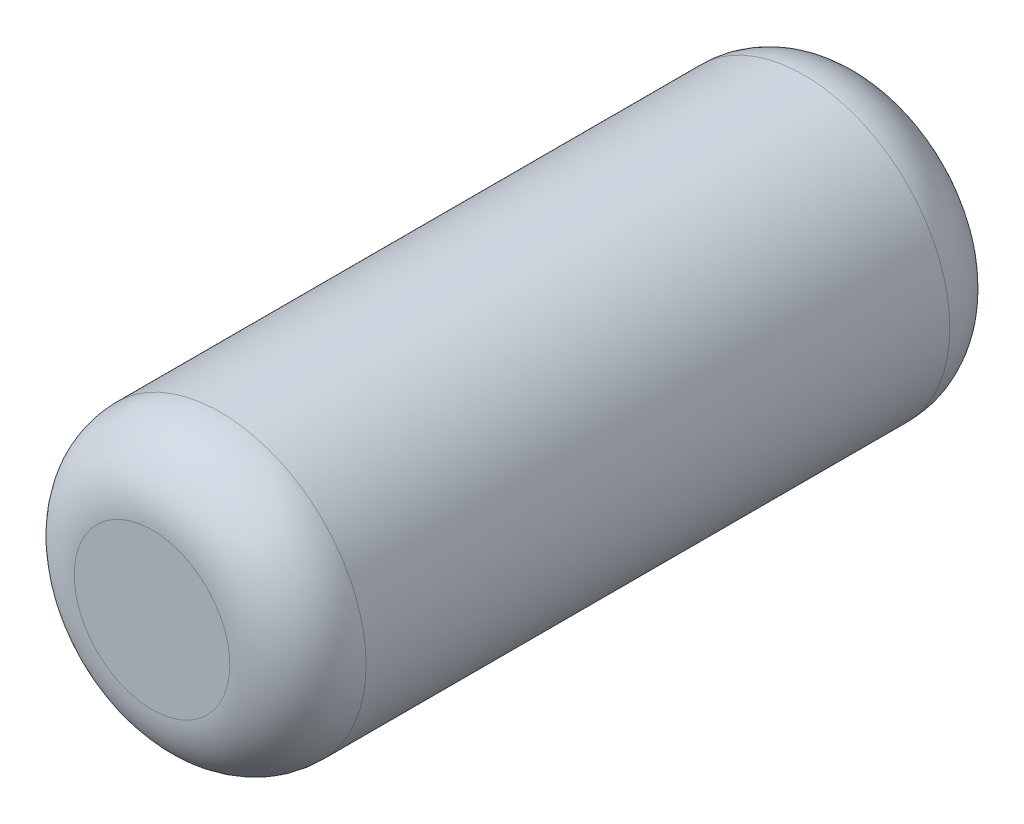
ISO-10303-21;
HEADER;
FILE_DESCRIPTION(('STEP AP214'),'2;1');
FILE_NAME('part.step','',(''),(''),'','','');
FILE_SCHEMA(('AUTOMOTIVE_DESIGN { 1 0 10303 214 1 1 1 1 }'));
ENDSEC;
DATA;
#1=APPLICATION_CONTEXT('core data for automotive mechanical design processes');
#2=APPLICATION_PROTOCOL_DEFINITION('international standard','automotive_design',2000,#1);
#3=PRODUCT_CONTEXT('',#1,'mechanical');
#4=PRODUCT('Part','Part','',(#3));
#5=PRODUCT_RELATED_PRODUCT_CATEGORY('part','',(#4));
#6=PRODUCT_DEFINITION_FORMATION('','',#4);
#7=PRODUCT_DEFINITION_CONTEXT('part definition',#1,'design');
#8=PRODUCT_DEFINITION('design','',#6,#7);
#9=PRODUCT_DEFINITION_SHAPE('','',#8);
#10=(LENGTH_UNIT() NAMED_UNIT(*) SI_UNIT(.MILLI.,.METRE.));
#11=(NAMED_UNIT(*) PLANE_ANGLE_UNIT() SI_UNIT($,.RADIAN.));
#12=(NAMED_UNIT(*) SI_UNIT($,.STERADIAN.) SOLID_ANGLE_UNIT());
#13=UNCERTAINTY_MEASURE_WITH_UNIT(LENGTH_MEASURE(1.E-05),#10,'distance_accuracy_value','');
#14=(GEOMETRIC_REPRESENTATION_CONTEXT(3) GLOBAL_UNCERTAINTY_ASSIGNED_CONTEXT((#13)) GLOBAL_UNIT_ASSIGNED_CONTEXT((#10,
#11,#12)) REPRESENTATION_CONTEXT('',''));
#15=CARTESIAN_POINT('',(0.,0.,0.));
#16=DIRECTION('',(0.,0.,1.));
#17=DIRECTION('',(1.,0.,0.));
#18=AXIS2_PLACEMENT_3D('',#15,#16,#17);
#19=CARTESIAN_POINT('',(0.,0.,1.85));
#20=DIRECTION('',(0.,0.,-1.));
#21=DIRECTION('',(-1.,0.,0.));
#22=AXIS2_PLACEMENT_3D('',#19,#20,#21);
#23=CYLINDRICAL_SURFACE('',#22,0.75);
#24=CARTESIAN_POINT('',(0.,0.,-1.5));
#25=DIRECTION('',(0.,0.,1.));
#26=DIRECTION('',(1.,0.,0.));
#27=AXIS2_PLACEMENT_3D('',#24,#25,#26);
#28=CIRCLE('',#27,0.75);
#29=CARTESIAN_POINT('',(0.75,0.,-1.5));
#30=VERTEX_POINT('',#29);
#31=EDGE_CURVE('E42',#30,#30,#28,.T.);
#32=ORIENTED_EDGE('',*,*,#31,.T.);
#33=EDGE_LOOP('',(#32));
#34=FACE_BOUND('',#33,.T.);
#35=CARTESIAN_POINT('',(0.,0.,1.5));
#36=DIRECTION('',(0.,0.,1.));
#37=DIRECTION('',(1.,0.,0.));
#38=AXIS2_PLACEMENT_3D('',#35,#36,#37);
#39=CIRCLE('',#38,0.75);
#40=CARTESIAN_POINT('',(0.75,0.,1.5));
#41=VERTEX_POINT('',#40);
#42=EDGE_CURVE('E46',#41,#41,#39,.F.);
#43=ORIENTED_EDGE('',*,*,#42,.T.);
#44=EDGE_LOOP('',(#43));
#45=FACE_BOUND('',#44,.T.);
#46=ADVANCED_FACE('F31',(#34,#45),#23,.T.);
#47=CARTESIAN_POINT('',(0.,0.,1.85));
#48=DIRECTION('',(0.,0.,1.));
#49=DIRECTION('',(1.,0.,0.));
#50=AXIS2_PLACEMENT_3D('',#47,#48,#49);
#51=PLANE('',#50);
#52=CARTESIAN_POINT('',(0.,0.,1.85));
#53=DIRECTION('',(0.,0.,1.));
#54=DIRECTION('',(1.,0.,0.));
#55=AXIS2_PLACEMENT_3D('',#52,#53,#54);
#56=CIRCLE('',#55,0.4);
#57=CARTESIAN_POINT('',(0.4,0.,1.85));
#58=VERTEX_POINT('',#57);
#59=EDGE_CURVE('E10',#58,#58,#56,.T.);
#60=ORIENTED_EDGE('',*,*,#59,.T.);
#61=EDGE_LOOP('',(#60));
#62=FACE_BOUND('',#61,.T.);
#63=ADVANCED_FACE('F62',(#62),#51,.T.);
#64=CARTESIAN_POINT('',(0.,0.,-1.85));
#65=DIRECTION('',(0.,0.,1.));
#66=DIRECTION('',(1.,0.,0.));
#67=AXIS2_PLACEMENT_3D('',#64,#65,#66);
#68=PLANE('',#67);
#69=CARTESIAN_POINT('',(0.,0.,-1.85));
#70=DIRECTION('',(0.,0.,1.));
#71=DIRECTION('',(1.,0.,0.));
#72=AXIS2_PLACEMENT_3D('',#69,#70,#71);
#73=CIRCLE('',#72,0.4);
#74=CARTESIAN_POINT('',(0.4,0.,-1.85));
#75=VERTEX_POINT('',#74);
#76=EDGE_CURVE('E38',#75,#75,#73,.F.);
#77=ORIENTED_EDGE('',*,*,#76,.T.);
#78=EDGE_LOOP('',(#77));
#79=FACE_BOUND('',#78,.T.);
#80=ADVANCED_FACE('F59',(#79),#68,.F.);
#81=CARTESIAN_POINT('',(0.,0.,-1.5));
#82=DIRECTION('',(0.,0.,1.));
#83=DIRECTION('',(1.,0.,0.));
#84=AXIS2_PLACEMENT_3D('',#81,#82,#83);
#85=TOROIDAL_SURFACE('',#84,0.4,0.35);
#86=ORIENTED_EDGE('',*,*,#76,.F.);
#87=EDGE_LOOP('',(#86));
#88=FACE_BOUND('',#87,.T.);
#89=ORIENTED_EDGE('',*,*,#31,.F.);
#90=EDGE_LOOP('',(#89));
#91=FACE_BOUND('',#90,.T.);
#92=ADVANCED_FACE('F55',(#88,#91),#85,.T.);
#93=CARTESIAN_POINT('',(0.,0.,1.5));
#94=DIRECTION('',(0.,0.,1.));
#95=DIRECTION('',(1.,0.,0.));
#96=AXIS2_PLACEMENT_3D('',#93,#94,#95);
#97=TOROIDAL_SURFACE('',#96,0.4,0.35);
#98=ORIENTED_EDGE('',*,*,#42,.F.);
#99=EDGE_LOOP('',(#98));
#100=FACE_BOUND('',#99,.T.);
#101=ORIENTED_EDGE('',*,*,#59,.F.);
#102=EDGE_LOOP('',(#101));
#103=FACE_BOUND('',#102,.T.);
#104=ADVANCED_FACE('F33',(#100,#103),#97,.T.);
#105=CLOSED_SHELL('',(#46,#63,#80,#92,#104));
#106=MANIFOLD_SOLID_BREP('B2',#105);
#107=ADVANCED_BREP_SHAPE_REPRESENTATION('',(#18,#106),#14);
#108=SHAPE_DEFINITION_REPRESENTATION(#9,#107);
ENDSEC;
END-ISO-10303-21;
